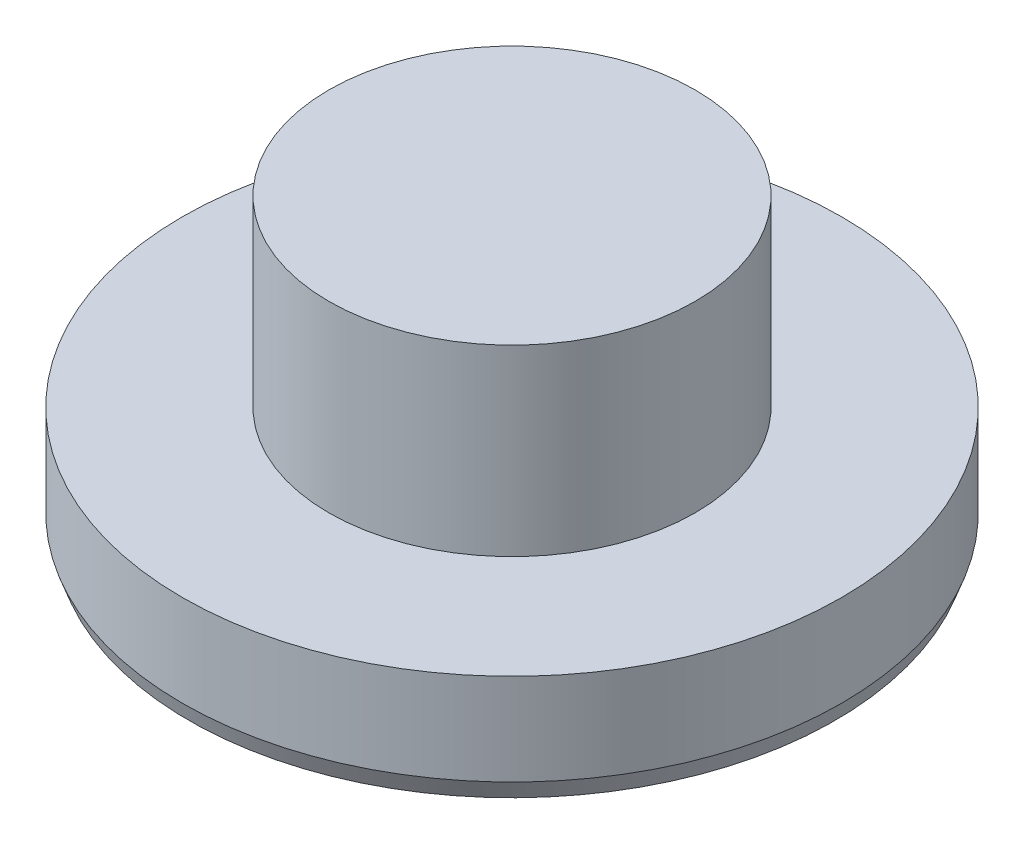
ISO-10303-21;
HEADER;
FILE_DESCRIPTION(('STEP AP214'),'2;1');
FILE_NAME('part.step','',(''),(''),'','','');
FILE_SCHEMA(('AUTOMOTIVE_DESIGN { 1 0 10303 214 1 1 1 1 }'));
ENDSEC;
DATA;
#1=APPLICATION_CONTEXT('core data for automotive mechanical design processes');
#2=APPLICATION_PROTOCOL_DEFINITION('international standard','automotive_design',2000,#1);
#3=PRODUCT_CONTEXT('',#1,'mechanical');
#4=PRODUCT('Part','Part','',(#3));
#5=PRODUCT_RELATED_PRODUCT_CATEGORY('part','',(#4));
#6=PRODUCT_DEFINITION_FORMATION('','',#4);
#7=PRODUCT_DEFINITION_CONTEXT('part definition',#1,'design');
#8=PRODUCT_DEFINITION('design','',#6,#7);
#9=PRODUCT_DEFINITION_SHAPE('','',#8);
#10=(LENGTH_UNIT() NAMED_UNIT(*) SI_UNIT(.MILLI.,.METRE.));
#11=(NAMED_UNIT(*) PLANE_ANGLE_UNIT() SI_UNIT($,.RADIAN.));
#12=(NAMED_UNIT(*) SI_UNIT($,.STERADIAN.) SOLID_ANGLE_UNIT());
#13=UNCERTAINTY_MEASURE_WITH_UNIT(LENGTH_MEASURE(1.E-05),#10,'distance_accuracy_value','');
#14=(GEOMETRIC_REPRESENTATION_CONTEXT(3) GLOBAL_UNCERTAINTY_ASSIGNED_CONTEXT((#13)) GLOBAL_UNIT_ASSIGNED_CONTEXT((#10,
#11,#12)) REPRESENTATION_CONTEXT('',''));
#15=CARTESIAN_POINT('',(0.,0.,0.));
#16=DIRECTION('',(0.,0.,1.));
#17=DIRECTION('',(1.,0.,0.));
#18=AXIS2_PLACEMENT_3D('',#15,#16,#17);
#19=CARTESIAN_POINT('',(9.,-3.,0.));
#20=DIRECTION('',(0.,-1.,0.));
#21=DIRECTION('',(0.,0.,-1.));
#22=AXIS2_PLACEMENT_3D('',#19,#20,#21);
#23=PLANE('',#22);
#24=CARTESIAN_POINT('',(0.,-3.,0.));
#25=DIRECTION('',(0.,-1.,0.));
#26=DIRECTION('',(0.,0.,-1.));
#27=AXIS2_PLACEMENT_3D('',#24,#25,#26);
#28=CIRCLE('',#27,8.8180148828669);
#29=CARTESIAN_POINT('',(0.,-3.,-8.8180148828669));
#30=VERTEX_POINT('',#29);
#31=EDGE_CURVE('E48',#30,#30,#28,.T.);
#32=ORIENTED_EDGE('',*,*,#31,.T.);
#33=EDGE_LOOP('',(#32));
#34=FACE_BOUND('',#33,.T.);
#35=CARTESIAN_POINT('',(0.,-3.,0.));
#36=DIRECTION('',(0.,-1.,0.));
#37=DIRECTION('',(0.,0.,-1.));
#38=AXIS2_PLACEMENT_3D('',#35,#36,#37);
#39=CIRCLE('',#38,7.00000000000001);
#40=CARTESIAN_POINT('',(0.,-3.,-7.00000000000001));
#41=VERTEX_POINT('',#40);
#42=EDGE_CURVE('E53',#41,#41,#39,.F.);
#43=ORIENTED_EDGE('',*,*,#42,.T.);
#44=EDGE_LOOP('',(#43));
#45=FACE_BOUND('',#44,.T.);
#46=ADVANCED_FACE('F39',(#34,#45),#23,.T.);
#47=CARTESIAN_POINT('',(0.,5.,0.));
#48=DIRECTION('',(0.,1.,0.));
#49=DIRECTION('',(0.,0.,1.));
#50=AXIS2_PLACEMENT_3D('',#47,#48,#49);
#51=PLANE('',#50);
#52=CARTESIAN_POINT('',(0.,5.,0.));
#53=DIRECTION('',(0.,-1.,0.));
#54=DIRECTION('',(0.,0.,-1.));
#55=AXIS2_PLACEMENT_3D('',#52,#53,#54);
#56=CIRCLE('',#55,5.);
#57=CARTESIAN_POINT('',(0.,5.,-5.));
#58=VERTEX_POINT('',#57);
#59=EDGE_CURVE('E64',#58,#58,#56,.T.);
#60=ORIENTED_EDGE('',*,*,#59,.F.);
#61=EDGE_LOOP('',(#60));
#62=FACE_BOUND('',#61,.T.);
#63=ADVANCED_FACE('F97',(#62),#51,.T.);
#64=CARTESIAN_POINT('',(0.,0.,0.));
#65=DIRECTION('',(0.,-1.,0.));
#66=DIRECTION('',(0.,0.,-1.));
#67=AXIS2_PLACEMENT_3D('',#64,#65,#66);
#68=CYLINDRICAL_SURFACE('',#67,5.);
#69=ORIENTED_EDGE('',*,*,#59,.T.);
#70=EDGE_LOOP('',(#69));
#71=FACE_BOUND('',#70,.T.);
#72=CARTESIAN_POINT('',(0.,0.,0.));
#73=DIRECTION('',(0.,-1.,0.));
#74=DIRECTION('',(0.,0.,-1.));
#75=AXIS2_PLACEMENT_3D('',#72,#73,#74);
#76=CIRCLE('',#75,5.);
#77=CARTESIAN_POINT('',(0.,0.,-5.));
#78=VERTEX_POINT('',#77);
#79=EDGE_CURVE('E68',#78,#78,#76,.T.);
#80=ORIENTED_EDGE('',*,*,#79,.F.);
#81=EDGE_LOOP('',(#80));
#82=FACE_BOUND('',#81,.T.);
#83=ADVANCED_FACE('F102',(#71,#82),#68,.T.);
#84=CARTESIAN_POINT('',(5.,0.,0.));
#85=DIRECTION('',(0.,1.,0.));
#86=DIRECTION('',(0.,0.,1.));
#87=AXIS2_PLACEMENT_3D('',#84,#85,#86);
#88=PLANE('',#87);
#89=ORIENTED_EDGE('',*,*,#79,.T.);
#90=EDGE_LOOP('',(#89));
#91=FACE_BOUND('',#90,.T.);
#92=CARTESIAN_POINT('',(0.,0.,0.));
#93=DIRECTION('',(0.,-1.,0.));
#94=DIRECTION('',(0.,0.,-1.));
#95=AXIS2_PLACEMENT_3D('',#92,#93,#94);
#96=CIRCLE('',#95,9.);
#97=CARTESIAN_POINT('',(0.,0.,-9.));
#98=VERTEX_POINT('',#97);
#99=EDGE_CURVE('E72',#98,#98,#96,.T.);
#100=ORIENTED_EDGE('',*,*,#99,.F.);
#101=EDGE_LOOP('',(#100));
#102=FACE_BOUND('',#101,.T.);
#103=ADVANCED_FACE('F94',(#91,#102),#88,.T.);
#104=CARTESIAN_POINT('',(0.,0.,0.));
#105=DIRECTION('',(0.,-1.,0.));
#106=DIRECTION('',(0.,0.,-1.));
#107=AXIS2_PLACEMENT_3D('',#104,#105,#106);
#108=CYLINDRICAL_SURFACE('',#107,9.);
#109=CARTESIAN_POINT('',(0.,-2.50000000000001,0.));
#110=DIRECTION('',(0.,-1.,0.));
#111=DIRECTION('',(0.,0.,-1.));
#112=AXIS2_PLACEMENT_3D('',#109,#110,#111);
#113=CIRCLE('',#112,9.);
#114=CARTESIAN_POINT('',(0.,-2.50000000000001,-9.));
#115=VERTEX_POINT('',#114);
#116=EDGE_CURVE('E10',#115,#115,#113,.F.);
#117=ORIENTED_EDGE('',*,*,#116,.T.);
#118=EDGE_LOOP('',(#117));
#119=FACE_BOUND('',#118,.T.);
#120=ORIENTED_EDGE('',*,*,#99,.T.);
#121=EDGE_LOOP('',(#120));
#122=FACE_BOUND('',#121,.T.);
#123=ADVANCED_FACE('F85',(#119,#122),#108,.T.);
#124=CARTESIAN_POINT('',(0.,-2.,0.));
#125=DIRECTION('',(0.,-1.,0.));
#126=DIRECTION('',(0.,0.,-1.));
#127=AXIS2_PLACEMENT_3D('',#124,#125,#126);
#128=CYLINDRICAL_SURFACE('',#127,6.);
#129=CARTESIAN_POINT('',(0.,-2.6360297657338,0.));
#130=DIRECTION('',(0.,-1.,0.));
#131=DIRECTION('',(0.,0.,-1.));
#132=AXIS2_PLACEMENT_3D('',#129,#130,#131);
#133=CIRCLE('',#132,6.);
#134=CARTESIAN_POINT('',(0.,-2.6360297657338,-6.));
#135=VERTEX_POINT('',#134);
#136=EDGE_CURVE('E58',#135,#135,#133,.T.);
#137=ORIENTED_EDGE('',*,*,#136,.T.);
#138=EDGE_LOOP('',(#137));
#139=FACE_BOUND('',#138,.T.);
#140=CARTESIAN_POINT('',(0.,-2.,0.));
#141=DIRECTION('',(0.,-1.,0.));
#142=DIRECTION('',(0.,0.,-1.));
#143=AXIS2_PLACEMENT_3D('',#140,#141,#142);
#144=CIRCLE('',#143,6.);
#145=CARTESIAN_POINT('',(0.,-2.,-6.));
#146=VERTEX_POINT('',#145);
#147=EDGE_CURVE('E76',#146,#146,#144,.T.);
#148=ORIENTED_EDGE('',*,*,#147,.F.);
#149=EDGE_LOOP('',(#148));
#150=FACE_BOUND('',#149,.T.);
#151=ADVANCED_FACE('F83',(#139,#150),#128,.F.);
#152=CARTESIAN_POINT('',(0.,-2.,0.));
#153=DIRECTION('',(0.,-1.,0.));
#154=DIRECTION('',(0.,0.,-1.));
#155=AXIS2_PLACEMENT_3D('',#152,#153,#154);
#156=PLANE('',#155);
#157=ORIENTED_EDGE('',*,*,#147,.T.);
#158=EDGE_LOOP('',(#157));
#159=FACE_BOUND('',#158,.T.);
#160=ADVANCED_FACE('F81',(#159),#156,.T.);
#161=CARTESIAN_POINT('',(0.,-2.6360297657338,0.));
#162=DIRECTION('',(0.,-1.,0.));
#163=DIRECTION('',(0.,0.,-1.));
#164=AXIS2_PLACEMENT_3D('',#161,#162,#163);
#165=CONICAL_SURFACE('',#164,6.,1.22173047639603);
#166=ORIENTED_EDGE('',*,*,#42,.F.);
#167=EDGE_LOOP('',(#166));
#168=FACE_BOUND('',#167,.T.);
#169=ORIENTED_EDGE('',*,*,#136,.F.);
#170=EDGE_LOOP('',(#169));
#171=FACE_BOUND('',#170,.T.);
#172=ADVANCED_FACE('F92',(#168,#171),#165,.F.);
#173=CARTESIAN_POINT('',(0.,-3.,0.));
#174=DIRECTION('',(0.,1.,0.));
#175=DIRECTION('',(0.,0.,1.));
#176=AXIS2_PLACEMENT_3D('',#173,#174,#175);
#177=CONICAL_SURFACE('',#176,8.8180148828669,0.349065850398865);
#178=ORIENTED_EDGE('',*,*,#116,.F.);
#179=EDGE_LOOP('',(#178));
#180=FACE_BOUND('',#179,.T.);
#181=ORIENTED_EDGE('',*,*,#31,.F.);
#182=EDGE_LOOP('',(#181));
#183=FACE_BOUND('',#182,.T.);
#184=ADVANCED_FACE('F42',(#180,#183),#177,.T.);
#185=CLOSED_SHELL('',(#46,#63,#83,#103,#123,#151,#160,#172,#184));
#186=MANIFOLD_SOLID_BREP('B2',#185);
#187=ADVANCED_BREP_SHAPE_REPRESENTATION('',(#18,#186),#14);
#188=SHAPE_DEFINITION_REPRESENTATION(#9,#187);
ENDSEC;
END-ISO-10303-21;
